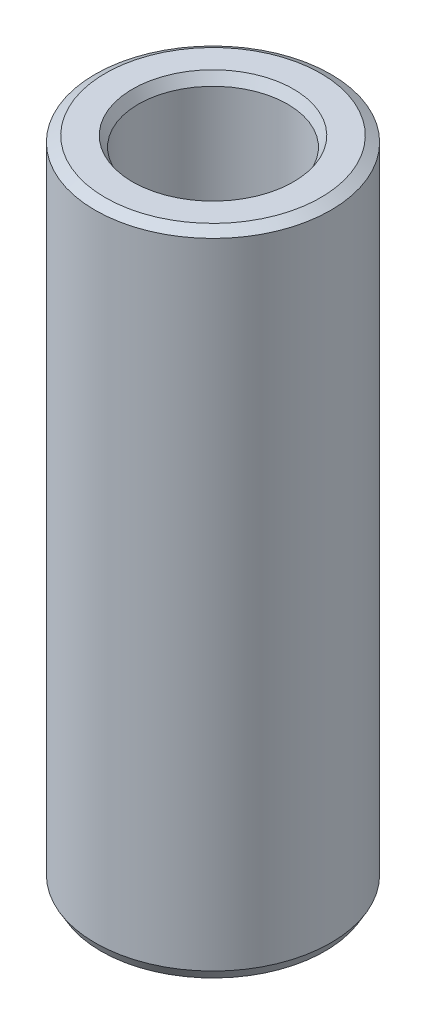
ISO-10303-21;
HEADER;
FILE_DESCRIPTION(('STEP AP214'),'2;1');
FILE_NAME('part.step','',(''),(''),'','','');
FILE_SCHEMA(('AUTOMOTIVE_DESIGN { 1 0 10303 214 1 1 1 1 }'));
ENDSEC;
DATA;
#1=APPLICATION_CONTEXT('core data for automotive mechanical design processes');
#2=APPLICATION_PROTOCOL_DEFINITION('international standard','automotive_design',2000,#1);
#3=PRODUCT_CONTEXT('',#1,'mechanical');
#4=PRODUCT('Part','Part','',(#3));
#5=PRODUCT_RELATED_PRODUCT_CATEGORY('part','',(#4));
#6=PRODUCT_DEFINITION_FORMATION('','',#4);
#7=PRODUCT_DEFINITION_CONTEXT('part definition',#1,'design');
#8=PRODUCT_DEFINITION('design','',#6,#7);
#9=PRODUCT_DEFINITION_SHAPE('','',#8);
#10=(LENGTH_UNIT() NAMED_UNIT(*) SI_UNIT(.MILLI.,.METRE.));
#11=(NAMED_UNIT(*) PLANE_ANGLE_UNIT() SI_UNIT($,.RADIAN.));
#12=(NAMED_UNIT(*) SI_UNIT($,.STERADIAN.) SOLID_ANGLE_UNIT());
#13=UNCERTAINTY_MEASURE_WITH_UNIT(LENGTH_MEASURE(1.E-05),#10,'distance_accuracy_value','');
#14=(GEOMETRIC_REPRESENTATION_CONTEXT(3) GLOBAL_UNCERTAINTY_ASSIGNED_CONTEXT((#13)) GLOBAL_UNIT_ASSIGNED_CONTEXT((#10,
#11,#12)) REPRESENTATION_CONTEXT('',''));
#15=CARTESIAN_POINT('',(0.,0.,0.));
#16=DIRECTION('',(0.,0.,1.));
#17=DIRECTION('',(1.,0.,0.));
#18=AXIS2_PLACEMENT_3D('',#15,#16,#17);
#19=CARTESIAN_POINT('',(0.,55.1978253890733,0.));
#20=DIRECTION('',(0.,-1.,0.));
#21=DIRECTION('',(0.,0.,-1.));
#22=AXIS2_PLACEMENT_3D('',#19,#20,#21);
#23=CYLINDRICAL_SURFACE('',#22,10.);
#24=CARTESIAN_POINT('',(0.,0.861274236376101,0.));
#25=DIRECTION('',(0.,1.,0.));
#26=DIRECTION('',(0.,0.,1.));
#27=AXIS2_PLACEMENT_3D('',#24,#25,#26);
#28=CIRCLE('',#27,10.);
#29=CARTESIAN_POINT('',(0.,0.861274236376094,-10.));
#30=VERTEX_POINT('',#29);
#31=EDGE_CURVE('E10',#30,#30,#28,.T.);
#32=CARTESIAN_POINT('',(0.,54.7005684768556,0.));
#33=DIRECTION('',(0.,1.,0.));
#34=DIRECTION('',(0.,0.,1.));
#35=AXIS2_PLACEMENT_3D('',#32,#33,#34);
#36=CIRCLE('',#35,10.);
#37=CARTESIAN_POINT('',(0.,54.7005684768556,-10.));
#38=VERTEX_POINT('',#37);
#39=EDGE_CURVE('E50',#38,#38,#36,.F.);
#40=CARTESIAN_POINT('',(0.,0.861274236376094,-10.));
#41=CARTESIAN_POINT('',(0.,1.42210021804776,-10.));
#42=CARTESIAN_POINT('',(0.,1.98292619971942,-10.));
#43=CARTESIAN_POINT('',(0.,3.10457816306274,-10.));
#44=CARTESIAN_POINT('',(0.,3.6654041447344,-10.));
#45=CARTESIAN_POINT('',(0.,4.78705610807773,-10.));
#46=CARTESIAN_POINT('',(0.,5.34788208974939,-10.));
#47=CARTESIAN_POINT('',(0.,6.46953405309271,-10.));
#48=CARTESIAN_POINT('',(0.,7.03036003476437,-10.));
#49=CARTESIAN_POINT('',(0.,8.15201199810769,-10.));
#50=CARTESIAN_POINT('',(0.,8.71283797977936,-10.));
#51=CARTESIAN_POINT('',(0.,9.83448994312268,-10.));
#52=CARTESIAN_POINT('',(0.,10.3953159247943,-10.));
#53=CARTESIAN_POINT('',(0.,11.5169678881377,-10.));
#54=CARTESIAN_POINT('',(0.,12.0777938698093,-10.));
#55=CARTESIAN_POINT('',(0.,13.1994458331526,-10.));
#56=CARTESIAN_POINT('',(0.,13.7602718148243,-10.));
#57=CARTESIAN_POINT('',(0.,14.8819237781676,-10.));
#58=CARTESIAN_POINT('',(0.,15.4427497598393,-10.));
#59=CARTESIAN_POINT('',(0.,16.5644017231826,-10.));
#60=CARTESIAN_POINT('',(0.,17.1252277048543,-10.));
#61=CARTESIAN_POINT('',(0.,18.2468796681976,-10.));
#62=CARTESIAN_POINT('',(0.,18.8077056498693,-10.));
#63=CARTESIAN_POINT('',(0.,19.9293576132126,-10.));
#64=CARTESIAN_POINT('',(0.,20.4901835948842,-10.));
#65=CARTESIAN_POINT('',(0.,21.6118355582276,-10.));
#66=CARTESIAN_POINT('',(0.,22.1726615398992,-10.));
#67=CARTESIAN_POINT('',(0.,23.2943135032425,-10.));
#68=CARTESIAN_POINT('',(0.,23.8551394849142,-10.));
#69=CARTESIAN_POINT('',(0.,24.9767914482575,-10.));
#70=CARTESIAN_POINT('',(0.,25.5376174299292,-10.));
#71=CARTESIAN_POINT('',(0.,26.6592693932725,-10.));
#72=CARTESIAN_POINT('',(0.,27.2200953749442,-10.));
#73=CARTESIAN_POINT('',(0.,28.3417473382875,-10.));
#74=CARTESIAN_POINT('',(0.,28.9025733199592,-10.));
#75=CARTESIAN_POINT('',(0.,30.0242252833025,-10.));
#76=CARTESIAN_POINT('',(0.,30.5850512649741,-10.));
#77=CARTESIAN_POINT('',(0.,31.7067032283175,-10.));
#78=CARTESIAN_POINT('',(0.,32.2675292099891,-10.));
#79=CARTESIAN_POINT('',(0.,33.3891811733324,-10.));
#80=CARTESIAN_POINT('',(0.,33.9500071550041,-10.));
#81=CARTESIAN_POINT('',(0.,35.0716591183474,-10.));
#82=CARTESIAN_POINT('',(0.,35.6324851000191,-10.));
#83=CARTESIAN_POINT('',(0.,36.7541370633624,-10.));
#84=CARTESIAN_POINT('',(0.,37.3149630450341,-10.));
#85=CARTESIAN_POINT('',(0.,38.4366150083774,-10.));
#86=CARTESIAN_POINT('',(0.,38.997440990049,-10.));
#87=CARTESIAN_POINT('',(0.,40.1190929533924,-10.));
#88=CARTESIAN_POINT('',(0.,40.679918935064,-10.));
#89=CARTESIAN_POINT('',(0.,41.8015708984074,-10.));
#90=CARTESIAN_POINT('',(0.,42.362396880079,-10.));
#91=CARTESIAN_POINT('',(0.,43.4840488434223,-10.));
#92=CARTESIAN_POINT('',(0.,44.044874825094,-10.));
#93=CARTESIAN_POINT('',(0.,45.1665267884373,-10.));
#94=CARTESIAN_POINT('',(0.,45.727352770109,-10.));
#95=CARTESIAN_POINT('',(0.,46.8490047334523,-10.));
#96=CARTESIAN_POINT('',(0.,47.409830715124,-10.));
#97=CARTESIAN_POINT('',(0.,48.5314826784673,-10.));
#98=CARTESIAN_POINT('',(0.,49.092308660139,-10.));
#99=CARTESIAN_POINT('',(0.,50.2139606234823,-10.));
#100=CARTESIAN_POINT('',(0.,50.7747866051539,-10.));
#101=CARTESIAN_POINT('',(0.,51.8964385684973,-10.));
#102=CARTESIAN_POINT('',(0.,52.4572645501689,-10.));
#103=CARTESIAN_POINT('',(0.,53.5789165135122,-10.));
#104=CARTESIAN_POINT('',(0.,54.1397424951839,-10.));
#105=CARTESIAN_POINT('',(0.,54.7005684768556,-10.));
#106=B_SPLINE_CURVE_WITH_KNOTS('',3,(#40,#41,#42,#43,#44,#45,#46,#47,#48,#49,#50,#51,#52,#53,
#54,#55,#56,#57,#58,#59,#60,#61,#62,#63,#64,#65,#66,#67,#68,#69,#70,#71,#72,#73,#74,#75,#76,#77,
#78,#79,#80,#81,#82,#83,#84,#85,#86,#87,#88,#89,#90,#91,#92,#93,#94,#95,#96,#97,#98,#99,#100,
#101,#102,#103,#104,#105),.UNSPECIFIED.,.F.,.F.,(4,2,2,2,2,2,2,2,2,2,2,2,2,2,2,2,2,2,2,2,2,2,2,
2,2,2,2,2,2,2,2,2,4),(0.,1.68247794501498,3.36495589002997,5.04743383504495,6.72991178005994,
8.41238972507492,10.0948676700899,11.7773456151049,13.4598235601199,15.1423015051349,
16.8247794501498,18.5072573951648,20.1897353401798,21.8722132851948,23.5546912302098,
25.2371691752248,26.9196471202397,28.6021250652547,30.2846030102697,31.9670809552847,
33.6495589002997,35.3320368453146,37.0145147903296,38.6969927353446,40.3794706803596,
42.0619486253746,43.7444265703896,45.4269045154046,47.1093824604195,48.7918604054345,
50.4743383504495,52.1568162954645,53.8392942404795),.UNSPECIFIED.);
#107=EDGE_CURVE('BSEAM39',#30,#38,#106,.T.);
#108=ORIENTED_EDGE('',*,*,#31,.T.);
#109=ORIENTED_EDGE('',*,*,#39,.T.);
#110=ORIENTED_EDGE('',*,*,#107,.T.);
#111=ORIENTED_EDGE('',*,*,#107,.F.);
#112=EDGE_LOOP('',(#108,#110,#109,#111));
#113=FACE_BOUND('',#112,.T.);
#114=ADVANCED_FACE('F39',(#113),#23,.T.);
#115=CARTESIAN_POINT('',(0.,55.1978253890733,0.));
#116=DIRECTION('',(0.,1.,0.));
#117=DIRECTION('',(0.,0.,1.));
#118=AXIS2_PLACEMENT_3D('',#115,#116,#117);
#119=PLANE('',#118);
#120=CARTESIAN_POINT('',(0.,55.1978253890733,0.));
#121=DIRECTION('',(0.,1.,0.));
#122=DIRECTION('',(0.,0.,1.));
#123=AXIS2_PLACEMENT_3D('',#120,#121,#122);
#124=CIRCLE('',#123,6.82779922641347);
#125=CARTESIAN_POINT('',(0.,55.1978253890733,6.82779922641347));
#126=VERTEX_POINT('',#125);
#127=EDGE_CURVE('E58',#126,#126,#124,.F.);
#128=ORIENTED_EDGE('',*,*,#127,.T.);
#129=EDGE_LOOP('',(#128));
#130=FACE_BOUND('',#129,.T.);
#131=CARTESIAN_POINT('',(0.,55.1978253890733,0.));
#132=DIRECTION('',(0.,1.,0.));
#133=DIRECTION('',(0.,0.,1.));
#134=AXIS2_PLACEMENT_3D('',#131,#132,#133);
#135=CIRCLE('',#134,9.13872576362402);
#136=CARTESIAN_POINT('',(0.,55.1978253890733,9.13872576362402));
#137=VERTEX_POINT('',#136);
#138=EDGE_CURVE('E61',#137,#137,#135,.T.);
#139=ORIENTED_EDGE('',*,*,#138,.T.);
#140=EDGE_LOOP('',(#139));
#141=FACE_BOUND('',#140,.T.);
#142=ADVANCED_FACE('F88',(#130,#141),#119,.T.);
#143=CARTESIAN_POINT('',(0.,0.,0.));
#144=DIRECTION('',(0.,1.,0.));
#145=DIRECTION('',(0.,0.,1.));
#146=AXIS2_PLACEMENT_3D('',#143,#144,#145);
#147=PLANE('',#146);
#148=CARTESIAN_POINT('',(0.,0.,0.));
#149=DIRECTION('',(0.,1.,0.));
#150=DIRECTION('',(0.,0.,1.));
#151=AXIS2_PLACEMENT_3D('',#148,#149,#150);
#152=CIRCLE('',#151,7.19181655057163);
#153=CARTESIAN_POINT('',(0.,0.,7.19181655057163));
#154=VERTEX_POINT('',#153);
#155=EDGE_CURVE('E51',#154,#154,#152,.T.);
#156=ORIENTED_EDGE('',*,*,#155,.T.);
#157=EDGE_LOOP('',(#156));
#158=FACE_BOUND('',#157,.T.);
#159=CARTESIAN_POINT('',(0.,0.,0.));
#160=DIRECTION('',(0.,1.,0.));
#161=DIRECTION('',(0.,0.,1.));
#162=AXIS2_PLACEMENT_3D('',#159,#160,#161);
#163=CIRCLE('',#162,9.50274308778217);
#164=CARTESIAN_POINT('',(0.,0.,9.50274308778217));
#165=VERTEX_POINT('',#164);
#166=EDGE_CURVE('E54',#165,#165,#163,.F.);
#167=ORIENTED_EDGE('',*,*,#166,.T.);
#168=EDGE_LOOP('',(#167));
#169=FACE_BOUND('',#168,.T.);
#170=ADVANCED_FACE('F83',(#158,#169),#147,.F.);
#171=CARTESIAN_POINT('',(0.,55.1978253890733,0.));
#172=DIRECTION('',(0.,-1.,0.));
#173=DIRECTION('',(0.,0.,-1.));
#174=AXIS2_PLACEMENT_3D('',#171,#172,#173);
#175=CYLINDRICAL_SURFACE('',#174,6.33054231419565);
#176=CARTESIAN_POINT('',(0.,54.3365511526973,0.));
#177=DIRECTION('',(0.,1.,0.));
#178=DIRECTION('',(0.,0.,1.));
#179=AXIS2_PLACEMENT_3D('',#176,#177,#178);
#180=CIRCLE('',#179,6.33054231419565);
#181=CARTESIAN_POINT('',(0.,54.3365511526972,-6.33054231419565));
#182=VERTEX_POINT('',#181);
#183=EDGE_CURVE('E67',#182,#182,#180,.T.);
#184=CARTESIAN_POINT('',(0.,0.497256912217768,0.));
#185=DIRECTION('',(0.,1.,0.));
#186=DIRECTION('',(0.,0.,1.));
#187=AXIS2_PLACEMENT_3D('',#184,#185,#186);
#188=CIRCLE('',#187,6.33054231419565);
#189=CARTESIAN_POINT('',(0.,0.497256912217761,-6.33054231419565));
#190=VERTEX_POINT('',#189);
#191=EDGE_CURVE('E69',#190,#190,#188,.F.);
#192=CARTESIAN_POINT('',(0.,54.3365511526972,-6.33054231419565));
#193=CARTESIAN_POINT('',(0.,53.7757251710256,-6.33054231419565));
#194=CARTESIAN_POINT('',(0.,53.2148991893539,-6.33054231419565));
#195=CARTESIAN_POINT('',(0.,52.0932472260106,-6.33054231419565));
#196=CARTESIAN_POINT('',(0.,51.5324212443389,-6.33054231419565));
#197=CARTESIAN_POINT('',(0.,50.4107692809956,-6.33054231419565));
#198=CARTESIAN_POINT('',(0.,49.849943299324,-6.33054231419565));
#199=CARTESIAN_POINT('',(0.,48.7282913359806,-6.33054231419565));
#200=CARTESIAN_POINT('',(0.,48.167465354309,-6.33054231419565));
#201=CARTESIAN_POINT('',(0.,47.0458133909657,-6.33054231419565));
#202=CARTESIAN_POINT('',(0.,46.484987409294,-6.33054231419565));
#203=CARTESIAN_POINT('',(0.,45.3633354459507,-6.33054231419565));
#204=CARTESIAN_POINT('',(0.,44.802509464279,-6.33054231419565));
#205=CARTESIAN_POINT('',(0.,43.6808575009357,-6.33054231419565));
#206=CARTESIAN_POINT('',(0.,43.120031519264,-6.33054231419565));
#207=CARTESIAN_POINT('',(0.,41.9983795559207,-6.33054231419565));
#208=CARTESIAN_POINT('',(0.,41.437553574249,-6.33054231419565));
#209=CARTESIAN_POINT('',(0.,40.3159016109057,-6.33054231419565));
#210=CARTESIAN_POINT('',(0.,39.7550756292341,-6.33054231419565));
#211=CARTESIAN_POINT('',(0.,38.6334236658907,-6.33054231419565));
#212=CARTESIAN_POINT('',(0.,38.0725976842191,-6.33054231419565));
#213=CARTESIAN_POINT('',(0.,36.9509457208757,-6.33054231419565));
#214=CARTESIAN_POINT('',(0.,36.3901197392041,-6.33054231419565));
#215=CARTESIAN_POINT('',(0.,35.2684677758608,-6.33054231419565));
#216=CARTESIAN_POINT('',(0.,34.7076417941891,-6.33054231419565));
#217=CARTESIAN_POINT('',(0.,33.5859898308458,-6.33054231419565));
#218=CARTESIAN_POINT('',(0.,33.0251638491741,-6.33054231419565));
#219=CARTESIAN_POINT('',(0.,31.9035118858308,-6.33054231419565));
#220=CARTESIAN_POINT('',(0.,31.3426859041591,-6.33054231419565));
#221=CARTESIAN_POINT('',(0.,30.2210339408158,-6.33054231419565));
#222=CARTESIAN_POINT('',(0.,29.6602079591442,-6.33054231419565));
#223=CARTESIAN_POINT('',(0.,28.5385559958008,-6.33054231419565));
#224=CARTESIAN_POINT('',(0.,27.9777300141292,-6.33054231419565));
#225=CARTESIAN_POINT('',(0.,26.8560780507858,-6.33054231419565));
#226=CARTESIAN_POINT('',(0.,26.2952520691142,-6.33054231419565));
#227=CARTESIAN_POINT('',(0.,25.1736001057709,-6.33054231419565));
#228=CARTESIAN_POINT('',(0.,24.6127741240992,-6.33054231419565));
#229=CARTESIAN_POINT('',(0.,23.4911221607559,-6.33054231419565));
#230=CARTESIAN_POINT('',(0.,22.9302961790842,-6.33054231419565));
#231=CARTESIAN_POINT('',(0.,21.8086442157409,-6.33054231419565));
#232=CARTESIAN_POINT('',(0.,21.2478182340692,-6.33054231419565));
#233=CARTESIAN_POINT('',(0.,20.1261662707259,-6.33054231419565));
#234=CARTESIAN_POINT('',(0.,19.5653402890542,-6.33054231419565));
#235=CARTESIAN_POINT('',(0.,18.4436883257109,-6.33054231419565));
#236=CARTESIAN_POINT('',(0.,17.8828623440393,-6.33054231419565));
#237=CARTESIAN_POINT('',(0.,16.7612103806959,-6.33054231419565));
#238=CARTESIAN_POINT('',(0.,16.2003843990243,-6.33054231419565));
#239=CARTESIAN_POINT('',(0.,15.078732435681,-6.33054231419565));
#240=CARTESIAN_POINT('',(0.,14.5179064540093,-6.33054231419565));
#241=CARTESIAN_POINT('',(0.,13.396254490666,-6.33054231419565));
#242=CARTESIAN_POINT('',(0.,12.8354285089943,-6.33054231419565));
#243=CARTESIAN_POINT('',(0.,11.713776545651,-6.33054231419565));
#244=CARTESIAN_POINT('',(0.,11.1529505639793,-6.33054231419565));
#245=CARTESIAN_POINT('',(0.,10.031298600636,-6.33054231419565));
#246=CARTESIAN_POINT('',(0.,9.47047261896435,-6.33054231419565));
#247=CARTESIAN_POINT('',(0.,8.34882065562102,-6.33054231419565));
#248=CARTESIAN_POINT('',(0.,7.78799467394936,-6.33054231419565));
#249=CARTESIAN_POINT('',(0.,6.66634271060604,-6.33054231419565));
#250=CARTESIAN_POINT('',(0.,6.10551672893438,-6.33054231419565));
#251=CARTESIAN_POINT('',(0.,4.98386476559105,-6.33054231419565));
#252=CARTESIAN_POINT('',(0.,4.42303878391939,-6.33054231419565));
#253=CARTESIAN_POINT('',(0.,3.30138682057607,-6.33054231419565));
#254=CARTESIAN_POINT('',(0.,2.74056083890441,-6.33054231419565));
#255=CARTESIAN_POINT('',(0.,1.61890887556108,-6.33054231419565));
#256=CARTESIAN_POINT('',(0.,1.05808289388942,-6.33054231419565));
#257=CARTESIAN_POINT('',(0.,0.497256912217761,-6.33054231419565));
#258=B_SPLINE_CURVE_WITH_KNOTS('',3,(#192,#193,#194,#195,#196,#197,#198,#199,#200,#201,#202,
#203,#204,#205,#206,#207,#208,#209,#210,#211,#212,#213,#214,#215,#216,#217,#218,#219,#220,#221,
#222,#223,#224,#225,#226,#227,#228,#229,#230,#231,#232,#233,#234,#235,#236,#237,#238,#239,#240,
#241,#242,#243,#244,#245,#246,#247,#248,#249,#250,#251,#252,#253,#254,#255,#256,#257),
.UNSPECIFIED.,.F.,.F.,(4,2,2,2,2,2,2,2,2,2,2,2,2,2,2,2,2,2,2,2,2,2,2,2,2,2,2,2,2,2,2,2,4),(0.,
1.68247794501498,3.36495589002996,5.04743383504495,6.72991178005993,8.41238972507492,
10.0948676700899,11.7773456151049,13.4598235601199,15.1423015051349,16.8247794501498,
18.5072573951648,20.1897353401798,21.8722132851948,23.5546912302098,25.2371691752248,
26.9196471202397,28.6021250652547,30.2846030102697,31.9670809552847,33.6495589002997,
35.3320368453147,37.0145147903296,38.6969927353446,40.3794706803596,42.0619486253746,
43.7444265703896,45.4269045154046,47.1093824604195,48.7918604054345,50.4743383504495,
52.1568162954645,53.8392942404795),.UNSPECIFIED.);
#259=EDGE_CURVE('BSEAM71',#182,#190,#258,.T.);
#260=ORIENTED_EDGE('',*,*,#183,.T.);
#261=ORIENTED_EDGE('',*,*,#191,.T.);
#262=ORIENTED_EDGE('',*,*,#259,.T.);
#263=ORIENTED_EDGE('',*,*,#259,.F.);
#264=EDGE_LOOP('',(#260,#262,#261,#263));
#265=FACE_BOUND('',#264,.T.);
#266=ADVANCED_FACE('F71',(#265),#175,.F.);
#267=CARTESIAN_POINT('',(0.,54.3365511526973,0.));
#268=DIRECTION('',(0.,1.,0.));
#269=DIRECTION('',(0.,0.,1.));
#270=AXIS2_PLACEMENT_3D('',#267,#268,#269);
#271=CONICAL_SURFACE('',#270,6.33054231419565,0.523598775598297);
#272=ORIENTED_EDGE('',*,*,#127,.F.);
#273=EDGE_LOOP('',(#272));
#274=FACE_BOUND('',#273,.T.);
#275=ORIENTED_EDGE('',*,*,#183,.F.);
#276=EDGE_LOOP('',(#275));
#277=FACE_BOUND('',#276,.T.);
#278=ADVANCED_FACE('F77',(#274,#277),#271,.F.);
#279=CARTESIAN_POINT('',(0.,0.,0.));
#280=DIRECTION('',(0.,-1.,0.));
#281=DIRECTION('',(0.,0.,-1.));
#282=AXIS2_PLACEMENT_3D('',#279,#280,#281);
#283=CONICAL_SURFACE('',#282,7.19181655057163,1.04719755119659);
#284=ORIENTED_EDGE('',*,*,#191,.F.);
#285=EDGE_LOOP('',(#284));
#286=FACE_BOUND('',#285,.T.);
#287=ORIENTED_EDGE('',*,*,#155,.F.);
#288=EDGE_LOOP('',(#287));
#289=FACE_BOUND('',#288,.T.);
#290=ADVANCED_FACE('F73',(#286,#289),#283,.F.);
#291=CARTESIAN_POINT('',(0.,0.861274236376101,0.));
#292=DIRECTION('',(0.,1.,0.));
#293=DIRECTION('',(0.,0.,1.));
#294=AXIS2_PLACEMENT_3D('',#291,#292,#293);
#295=CONICAL_SURFACE('',#294,10.,0.523598775598302);
#296=ORIENTED_EDGE('',*,*,#166,.F.);
#297=EDGE_LOOP('',(#296));
#298=FACE_BOUND('',#297,.T.);
#299=ORIENTED_EDGE('',*,*,#31,.F.);
#300=EDGE_LOOP('',(#299));
#301=FACE_BOUND('',#300,.T.);
#302=ADVANCED_FACE('F76',(#298,#301),#295,.T.);
#303=CARTESIAN_POINT('',(0.,55.1978253890733,0.));
#304=DIRECTION('',(0.,-1.,0.));
#305=DIRECTION('',(0.,0.,-1.));
#306=AXIS2_PLACEMENT_3D('',#303,#304,#305);
#307=CONICAL_SURFACE('',#306,9.13872576362402,1.04719755119659);
#308=ORIENTED_EDGE('',*,*,#39,.F.);
#309=EDGE_LOOP('',(#308));
#310=FACE_BOUND('',#309,.T.);
#311=ORIENTED_EDGE('',*,*,#138,.F.);
#312=EDGE_LOOP('',(#311));
#313=FACE_BOUND('',#312,.T.);
#314=ADVANCED_FACE('F45',(#310,#313),#307,.T.);
#315=CLOSED_SHELL('',(#114,#142,#170,#266,#278,#290,#302,#314));
#316=MANIFOLD_SOLID_BREP('B2',#315);
#317=ADVANCED_BREP_SHAPE_REPRESENTATION('',(#18,#316),#14);
#318=SHAPE_DEFINITION_REPRESENTATION(#9,#317);
ENDSEC;
END-ISO-10303-21;
